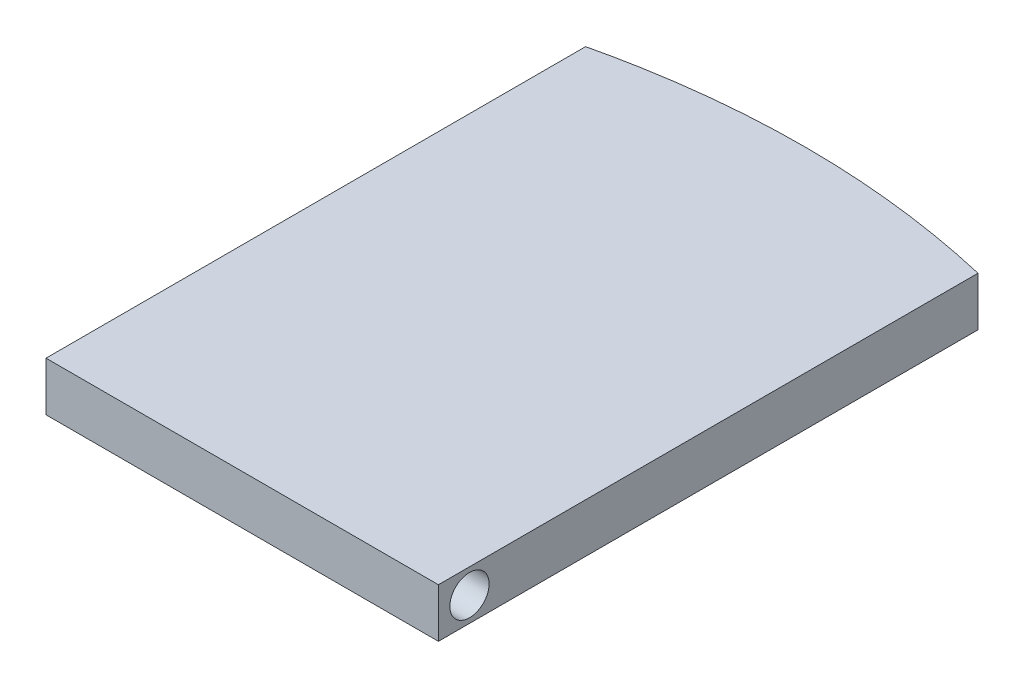
ISO-10303-21;
HEADER;
FILE_DESCRIPTION(('STEP AP214'),'2;1');
FILE_NAME('part.step','',(''),(''),'','','');
FILE_SCHEMA(('AUTOMOTIVE_DESIGN { 1 0 10303 214 1 1 1 1 }'));
ENDSEC;
DATA;
#1=APPLICATION_CONTEXT('core data for automotive mechanical design processes');
#2=APPLICATION_PROTOCOL_DEFINITION('international standard','automotive_design',2000,#1);
#3=PRODUCT_CONTEXT('',#1,'mechanical');
#4=PRODUCT('Part','Part','',(#3));
#5=PRODUCT_RELATED_PRODUCT_CATEGORY('part','',(#4));
#6=PRODUCT_DEFINITION_FORMATION('','',#4);
#7=PRODUCT_DEFINITION_CONTEXT('part definition',#1,'design');
#8=PRODUCT_DEFINITION('design','',#6,#7);
#9=PRODUCT_DEFINITION_SHAPE('','',#8);
#10=(LENGTH_UNIT() NAMED_UNIT(*) SI_UNIT(.MILLI.,.METRE.));
#11=(NAMED_UNIT(*) PLANE_ANGLE_UNIT() SI_UNIT($,.RADIAN.));
#12=(NAMED_UNIT(*) SI_UNIT($,.STERADIAN.) SOLID_ANGLE_UNIT());
#13=UNCERTAINTY_MEASURE_WITH_UNIT(LENGTH_MEASURE(1.E-05),#10,'distance_accuracy_value','');
#14=(GEOMETRIC_REPRESENTATION_CONTEXT(3) GLOBAL_UNCERTAINTY_ASSIGNED_CONTEXT((#13)) GLOBAL_UNIT_ASSIGNED_CONTEXT((#10,
#11,#12)) REPRESENTATION_CONTEXT('',''));
#15=CARTESIAN_POINT('',(0.,0.,0.));
#16=DIRECTION('',(0.,0.,1.));
#17=DIRECTION('',(1.,0.,0.));
#18=AXIS2_PLACEMENT_3D('',#15,#16,#17);
#19=CARTESIAN_POINT('',(0.,3.,0.));
#20=DIRECTION('',(1.,0.,0.));
#21=DIRECTION('',(0.,0.,-1.));
#22=AXIS2_PLACEMENT_3D('',#19,#20,#21);
#23=PLANE('',#22);
#24=CARTESIAN_POINT('',(0.,1.5,-2.5));
#25=DIRECTION('',(-1.,0.,0.));
#26=DIRECTION('',(0.,0.,1.));
#27=AXIS2_PLACEMENT_3D('',#24,#25,#26);
#28=CIRCLE('',#27,1.2);
#29=CARTESIAN_POINT('',(0.,1.5,-1.3));
#30=VERTEX_POINT('',#29);
#31=EDGE_CURVE('E133',#30,#30,#28,.T.);
#32=ORIENTED_EDGE('',*,*,#31,.F.);
#33=EDGE_LOOP('',(#32));
#34=FACE_BOUND('',#33,.T.);
#35=DIRECTION('',(0.,0.,1.));
#36=VECTOR('',#35,1.);
#37=CARTESIAN_POINT('',(0.,0.,0.));
#38=LINE('',#37,#36);
#39=CARTESIAN_POINT('',(0.,0.,-33.6));
#40=VERTEX_POINT('',#39);
#41=CARTESIAN_POINT('',(0.,0.,-0.600000000000003));
#42=VERTEX_POINT('',#41);
#43=EDGE_CURVE('E83',#40,#42,#38,.T.);
#44=ORIENTED_EDGE('',*,*,#43,.T.);
#45=DIRECTION('',(0.,1.,0.));
#46=VECTOR('',#45,1.);
#47=CARTESIAN_POINT('',(0.,0.,-0.6));
#48=LINE('',#47,#46);
#49=CARTESIAN_POINT('',(0.,3.,-0.6));
#50=VERTEX_POINT('',#49);
#51=EDGE_CURVE('E49',#42,#50,#48,.T.);
#52=ORIENTED_EDGE('',*,*,#51,.T.);
#53=DIRECTION('',(0.,0.,1.));
#54=VECTOR('',#53,1.);
#55=CARTESIAN_POINT('',(0.,3.,0.));
#56=LINE('',#55,#54);
#57=CARTESIAN_POINT('',(0.,3.,-33.6));
#58=VERTEX_POINT('',#57);
#59=EDGE_CURVE('E78',#58,#50,#56,.T.);
#60=ORIENTED_EDGE('',*,*,#59,.F.);
#61=DIRECTION('',(0.,-1.,0.));
#62=VECTOR('',#61,1.);
#63=CARTESIAN_POINT('',(0.,3.,-33.6));
#64=LINE('',#63,#62);
#65=EDGE_CURVE('E42',#58,#40,#64,.T.);
#66=ORIENTED_EDGE('',*,*,#65,.T.);
#67=EDGE_LOOP('',(#44,#52,#60,#66));
#68=FACE_BOUND('',#67,.T.);
#69=ADVANCED_FACE('F35',(#34,#68),#23,.F.);
#70=CARTESIAN_POINT('',(24.,3.,0.));
#71=DIRECTION('',(-1.,0.,0.));
#72=DIRECTION('',(0.,0.,1.));
#73=AXIS2_PLACEMENT_3D('',#70,#71,#72);
#74=PLANE('',#73);
#75=CARTESIAN_POINT('',(24.,1.5,-2.5));
#76=DIRECTION('',(1.,0.,0.));
#77=DIRECTION('',(0.,0.,-1.));
#78=AXIS2_PLACEMENT_3D('',#75,#76,#77);
#79=CIRCLE('',#78,1.2);
#80=CARTESIAN_POINT('',(24.,1.5,-3.7));
#81=VERTEX_POINT('',#80);
#82=EDGE_CURVE('E90',#81,#81,#79,.T.);
#83=ORIENTED_EDGE('',*,*,#82,.F.);
#84=EDGE_LOOP('',(#83));
#85=FACE_BOUND('',#84,.T.);
#86=DIRECTION('',(0.,0.,-1.));
#87=VECTOR('',#86,1.);
#88=CARTESIAN_POINT('',(24.,3.,0.));
#89=LINE('',#88,#87);
#90=CARTESIAN_POINT('',(24.,3.,-0.6));
#91=VERTEX_POINT('',#90);
#92=CARTESIAN_POINT('',(24.,3.,-33.6));
#93=VERTEX_POINT('',#92);
#94=EDGE_CURVE('E102',#91,#93,#89,.T.);
#95=ORIENTED_EDGE('',*,*,#94,.F.);
#96=DIRECTION('',(0.,1.,0.));
#97=VECTOR('',#96,1.);
#98=CARTESIAN_POINT('',(24.,0.,-0.6));
#99=LINE('',#98,#97);
#100=CARTESIAN_POINT('',(24.,0.,-0.6));
#101=VERTEX_POINT('',#100);
#102=EDGE_CURVE('E126',#101,#91,#99,.T.);
#103=ORIENTED_EDGE('',*,*,#102,.F.);
#104=DIRECTION('',(0.,0.,-1.));
#105=VECTOR('',#104,1.);
#106=CARTESIAN_POINT('',(24.,0.,0.));
#107=LINE('',#106,#105);
#108=CARTESIAN_POINT('',(24.,0.,-33.6));
#109=VERTEX_POINT('',#108);
#110=EDGE_CURVE('E79',#101,#109,#107,.T.);
#111=ORIENTED_EDGE('',*,*,#110,.T.);
#112=DIRECTION('',(0.,-1.,0.));
#113=VECTOR('',#112,1.);
#114=CARTESIAN_POINT('',(24.,3.,-33.6));
#115=LINE('',#114,#113);
#116=EDGE_CURVE('E11',#93,#109,#115,.T.);
#117=ORIENTED_EDGE('',*,*,#116,.F.);
#118=EDGE_LOOP('',(#95,#103,#111,#117));
#119=FACE_BOUND('',#118,.T.);
#120=ADVANCED_FACE('F111',(#85,#119),#74,.F.);
#121=CARTESIAN_POINT('',(24.,3.,-33.6));
#122=CARTESIAN_POINT('',(12.,3.,-36.4));
#123=CARTESIAN_POINT('',(0.,3.,-33.6));
#124=B_SPLINE_CURVE_WITH_KNOTS('',2,(#121,#122,#123),.UNSPECIFIED.,.F.,.F.,(3,3),(0.,1.),.UNSPECIFIED.);
#125=DIRECTION('',(0.,-1.,0.));
#126=VECTOR('',#125,1.);
#127=SURFACE_OF_LINEAR_EXTRUSION('',#124,#126);
#128=CARTESIAN_POINT('',(24.,0.,-33.6));
#129=CARTESIAN_POINT('',(12.,0.,-36.4));
#130=CARTESIAN_POINT('',(0.,0.,-33.6));
#131=B_SPLINE_CURVE_WITH_KNOTS('',2,(#128,#129,#130),.UNSPECIFIED.,.F.,.F.,(3,3),(0.,1.),.UNSPECIFIED.);
#132=EDGE_CURVE('E70',#109,#40,#131,.T.);
#133=ORIENTED_EDGE('',*,*,#132,.T.);
#134=ORIENTED_EDGE('',*,*,#65,.F.);
#135=EDGE_CURVE('E58',#93,#58,#124,.T.);
#136=ORIENTED_EDGE('',*,*,#135,.F.);
#137=ORIENTED_EDGE('',*,*,#116,.T.);
#138=EDGE_LOOP('',(#133,#134,#136,#137));
#139=FACE_BOUND('',#138,.T.);
#140=ADVANCED_FACE('F72',(#139),#127,.F.);
#141=CARTESIAN_POINT('',(12.,3.,-35.));
#142=DIRECTION('',(0.,1.,0.));
#143=DIRECTION('',(0.,0.,1.));
#144=AXIS2_PLACEMENT_3D('',#141,#142,#143);
#145=PLANE('',#144);
#146=DIRECTION('',(-1.,0.,0.));
#147=VECTOR('',#146,1.);
#148=CARTESIAN_POINT('',(0.,3.,-0.6));
#149=LINE('',#148,#147);
#150=EDGE_CURVE('E140',#91,#50,#149,.T.);
#151=ORIENTED_EDGE('',*,*,#150,.F.);
#152=ORIENTED_EDGE('',*,*,#94,.T.);
#153=ORIENTED_EDGE('',*,*,#135,.T.);
#154=ORIENTED_EDGE('',*,*,#59,.T.);
#155=EDGE_LOOP('',(#151,#152,#153,#154));
#156=FACE_BOUND('',#155,.T.);
#157=ADVANCED_FACE('F110',(#156),#145,.T.);
#158=CARTESIAN_POINT('',(12.,0.,-35.));
#159=DIRECTION('',(0.,1.,0.));
#160=DIRECTION('',(0.,0.,1.));
#161=AXIS2_PLACEMENT_3D('',#158,#159,#160);
#162=PLANE('',#161);
#163=ORIENTED_EDGE('',*,*,#110,.F.);
#164=DIRECTION('',(-1.,0.,0.));
#165=VECTOR('',#164,1.);
#166=CARTESIAN_POINT('',(0.,0.,-0.6));
#167=LINE('',#166,#165);
#168=EDGE_CURVE('E85',#101,#42,#167,.T.);
#169=ORIENTED_EDGE('',*,*,#168,.T.);
#170=ORIENTED_EDGE('',*,*,#43,.F.);
#171=ORIENTED_EDGE('',*,*,#132,.F.);
#172=EDGE_LOOP('',(#163,#169,#170,#171));
#173=FACE_BOUND('',#172,.T.);
#174=ADVANCED_FACE('F84',(#173),#162,.F.);
#175=CARTESIAN_POINT('',(17.,1.5,-2.5));
#176=DIRECTION('',(1.,0.,0.));
#177=DIRECTION('',(0.,0.,-1.));
#178=AXIS2_PLACEMENT_3D('',#175,#176,#177);
#179=CYLINDRICAL_SURFACE('',#178,1.2);
#180=CARTESIAN_POINT('',(17.,1.5,-2.5));
#181=DIRECTION('',(1.,0.,0.));
#182=DIRECTION('',(0.,0.,-1.));
#183=AXIS2_PLACEMENT_3D('',#180,#181,#182);
#184=CIRCLE('',#183,1.2);
#185=CARTESIAN_POINT('',(17.,1.5,-3.7));
#186=VERTEX_POINT('',#185);
#187=EDGE_CURVE('E86',#186,#186,#184,.T.);
#188=ORIENTED_EDGE('',*,*,#187,.F.);
#189=EDGE_LOOP('',(#188));
#190=FACE_BOUND('',#189,.T.);
#191=ORIENTED_EDGE('',*,*,#82,.T.);
#192=EDGE_LOOP('',(#191));
#193=FACE_BOUND('',#192,.T.);
#194=ADVANCED_FACE('F147',(#190,#193),#179,.F.);
#195=CARTESIAN_POINT('',(17.,1.5,-2.5));
#196=DIRECTION('',(1.,0.,0.));
#197=DIRECTION('',(0.,0.,-1.));
#198=AXIS2_PLACEMENT_3D('',#195,#196,#197);
#199=PLANE('',#198);
#200=ORIENTED_EDGE('',*,*,#187,.T.);
#201=EDGE_LOOP('',(#200));
#202=FACE_BOUND('',#201,.T.);
#203=ADVANCED_FACE('F151',(#202),#199,.T.);
#204=CARTESIAN_POINT('',(7.,1.5,-2.5));
#205=DIRECTION('',(-1.,0.,0.));
#206=DIRECTION('',(0.,0.,1.));
#207=AXIS2_PLACEMENT_3D('',#204,#205,#206);
#208=CYLINDRICAL_SURFACE('',#207,1.2);
#209=CARTESIAN_POINT('',(7.,1.5,-2.5));
#210=DIRECTION('',(-1.,0.,0.));
#211=DIRECTION('',(0.,0.,1.));
#212=AXIS2_PLACEMENT_3D('',#209,#210,#211);
#213=CIRCLE('',#212,1.2);
#214=CARTESIAN_POINT('',(7.,1.5,-1.3));
#215=VERTEX_POINT('',#214);
#216=EDGE_CURVE('E131',#215,#215,#213,.T.);
#217=ORIENTED_EDGE('',*,*,#216,.F.);
#218=EDGE_LOOP('',(#217));
#219=FACE_BOUND('',#218,.T.);
#220=ORIENTED_EDGE('',*,*,#31,.T.);
#221=EDGE_LOOP('',(#220));
#222=FACE_BOUND('',#221,.T.);
#223=ADVANCED_FACE('F155',(#219,#222),#208,.F.);
#224=CARTESIAN_POINT('',(7.,1.5,-2.5));
#225=DIRECTION('',(-1.,0.,0.));
#226=DIRECTION('',(0.,0.,1.));
#227=AXIS2_PLACEMENT_3D('',#224,#225,#226);
#228=PLANE('',#227);
#229=ORIENTED_EDGE('',*,*,#216,.T.);
#230=EDGE_LOOP('',(#229));
#231=FACE_BOUND('',#230,.T.);
#232=ADVANCED_FACE('F159',(#231),#228,.T.);
#233=CARTESIAN_POINT('',(0.,0.,-0.6));
#234=DIRECTION('',(0.,0.,-1.));
#235=DIRECTION('',(-1.,0.,0.));
#236=AXIS2_PLACEMENT_3D('',#233,#234,#235);
#237=PLANE('',#236);
#238=ORIENTED_EDGE('',*,*,#150,.T.);
#239=ORIENTED_EDGE('',*,*,#51,.F.);
#240=ORIENTED_EDGE('',*,*,#168,.F.);
#241=ORIENTED_EDGE('',*,*,#102,.T.);
#242=EDGE_LOOP('',(#238,#239,#240,#241));
#243=FACE_BOUND('',#242,.T.);
#244=ADVANCED_FACE('F142',(#243),#237,.F.);
#245=CLOSED_SHELL('',(#69,#120,#140,#157,#174,#194,#203,#223,#232,#244));
#246=MANIFOLD_SOLID_BREP('B2',#245);
#247=ADVANCED_BREP_SHAPE_REPRESENTATION('',(#18,#246),#14);
#248=SHAPE_DEFINITION_REPRESENTATION(#9,#247);
ENDSEC;
END-ISO-10303-21;
